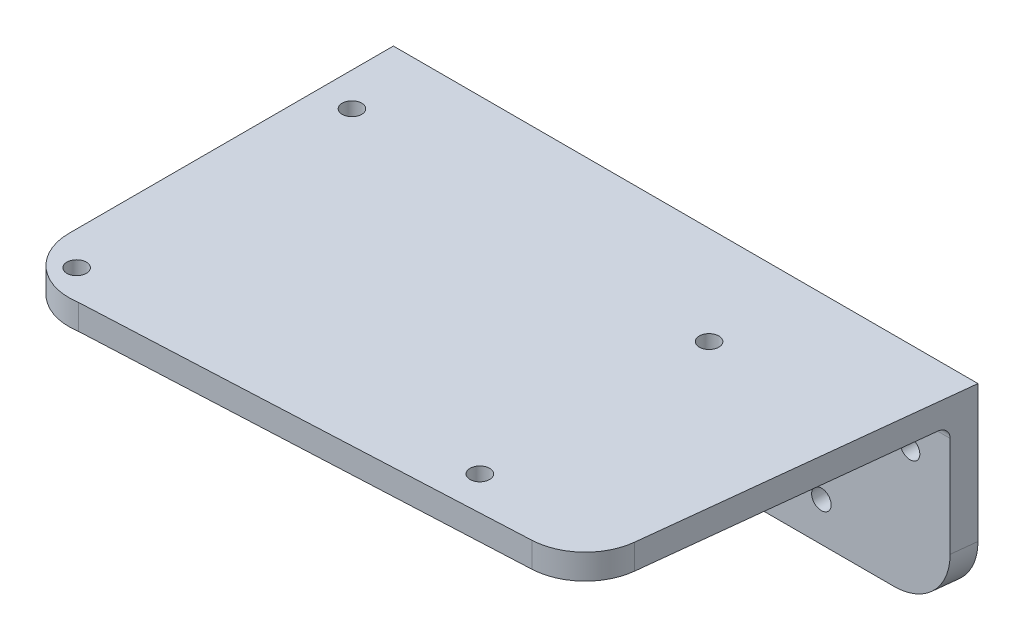
ISO-10303-21;
HEADER;
FILE_DESCRIPTION(('STEP AP214'),'2;1');
FILE_NAME('part.step','',(''),(''),'','','');
FILE_SCHEMA(('AUTOMOTIVE_DESIGN { 1 0 10303 214 1 1 1 1 }'));
ENDSEC;
DATA;
#1=APPLICATION_CONTEXT('core data for automotive mechanical design processes');
#2=APPLICATION_PROTOCOL_DEFINITION('international standard','automotive_design',2000,#1);
#3=PRODUCT_CONTEXT('',#1,'mechanical');
#4=PRODUCT('Part','Part','',(#3));
#5=PRODUCT_RELATED_PRODUCT_CATEGORY('part','',(#4));
#6=PRODUCT_DEFINITION_FORMATION('','',#4);
#7=PRODUCT_DEFINITION_CONTEXT('part definition',#1,'design');
#8=PRODUCT_DEFINITION('design','',#6,#7);
#9=PRODUCT_DEFINITION_SHAPE('','',#8);
#10=(LENGTH_UNIT() NAMED_UNIT(*) SI_UNIT(.MILLI.,.METRE.));
#11=(NAMED_UNIT(*) PLANE_ANGLE_UNIT() SI_UNIT($,.RADIAN.));
#12=(NAMED_UNIT(*) SI_UNIT($,.STERADIAN.) SOLID_ANGLE_UNIT());
#13=UNCERTAINTY_MEASURE_WITH_UNIT(LENGTH_MEASURE(1.E-05),#10,'distance_accuracy_value','');
#14=(GEOMETRIC_REPRESENTATION_CONTEXT(3) GLOBAL_UNCERTAINTY_ASSIGNED_CONTEXT((#13)) GLOBAL_UNIT_ASSIGNED_CONTEXT((#10,
#11,#12)) REPRESENTATION_CONTEXT('',''));
#15=CARTESIAN_POINT('',(0.,0.,0.));
#16=DIRECTION('',(0.,0.,1.));
#17=DIRECTION('',(1.,0.,0.));
#18=AXIS2_PLACEMENT_3D('',#15,#16,#17);
#19=CARTESIAN_POINT('',(0.,0.,0.));
#20=DIRECTION('',(0.,1.,0.));
#21=DIRECTION('',(0.,0.,1.));
#22=AXIS2_PLACEMENT_3D('',#19,#20,#21);
#23=PLANE('',#22);
#24=CARTESIAN_POINT('',(-43.7355525514214,0.,-28.3752913949086));
#25=DIRECTION('',(0.,1.,0.));
#26=DIRECTION('',(0.,0.,1.));
#27=AXIS2_PLACEMENT_3D('',#24,#25,#26);
#28=CIRCLE('',#27,1.75);
#29=CARTESIAN_POINT('',(-43.7355525514214,0.,-26.6252913949086));
#30=VERTEX_POINT('',#29);
#31=EDGE_CURVE('E391',#30,#30,#28,.F.);
#32=ORIENTED_EDGE('',*,*,#31,.F.);
#33=EDGE_LOOP('',(#32));
#34=FACE_BOUND('',#33,.T.);
#35=CARTESIAN_POINT('',(-43.7355525514214,0.,20.9485580018877));
#36=DIRECTION('',(0.,1.,0.));
#37=DIRECTION('',(0.,0.,1.));
#38=AXIS2_PLACEMENT_3D('',#35,#36,#37);
#39=CIRCLE('',#38,1.75);
#40=CARTESIAN_POINT('',(-43.7355525514214,0.,22.6985580018877));
#41=VERTEX_POINT('',#40);
#42=EDGE_CURVE('E392',#41,#41,#39,.F.);
#43=ORIENTED_EDGE('',*,*,#42,.F.);
#44=EDGE_LOOP('',(#43));
#45=FACE_BOUND('',#44,.T.);
#46=CARTESIAN_POINT('',(24.3726184912332,0.,16.8165832662366));
#47=DIRECTION('',(0.,1.,0.));
#48=DIRECTION('',(0.,0.,1.));
#49=AXIS2_PLACEMENT_3D('',#46,#47,#48);
#50=CIRCLE('',#49,1.75);
#51=CARTESIAN_POINT('',(24.3726184912332,0.,18.5665832662366));
#52=VERTEX_POINT('',#51);
#53=EDGE_CURVE('E401',#52,#52,#50,.F.);
#54=ORIENTED_EDGE('',*,*,#53,.F.);
#55=EDGE_LOOP('',(#54));
#56=FACE_BOUND('',#55,.T.);
#57=CARTESIAN_POINT('',(24.3726184912332,0.,-24.2433166592575));
#58=DIRECTION('',(0.,1.,0.));
#59=DIRECTION('',(0.,0.,1.));
#60=AXIS2_PLACEMENT_3D('',#57,#58,#59);
#61=CIRCLE('',#60,1.75);
#62=CARTESIAN_POINT('',(24.3726184912332,0.,-22.4933166592575));
#63=VERTEX_POINT('',#62);
#64=EDGE_CURVE('E409',#63,#63,#61,.F.);
#65=ORIENTED_EDGE('',*,*,#64,.F.);
#66=EDGE_LOOP('',(#65));
#67=FACE_BOUND('',#66,.T.);
#68=DIRECTION('',(0.,0.,-1.));
#69=VECTOR('',#68,1.);
#70=CARTESIAN_POINT('',(-8.13875231369826,0.,0.));
#71=LINE('',#70,#69);
#72=CARTESIAN_POINT('',(-8.13875231369825,0.,14.3090968347566));
#73=VERTEX_POINT('',#72);
#74=CARTESIAN_POINT('',(-8.13875231369825,0.,-35.320488279099));
#75=VERTEX_POINT('',#74);
#76=EDGE_CURVE('E288',#73,#75,#71,.T.);
#77=ORIENTED_EDGE('',*,*,#76,.T.);
#78=DIRECTION('',(-1.,0.,0.));
#79=VECTOR('',#78,1.);
#80=CARTESIAN_POINT('',(12.8612587318722,0.,-35.320488279099));
#81=LINE('',#80,#79);
#82=CARTESIAN_POINT('',(12.8612587318722,0.,-35.320488279099));
#83=VERTEX_POINT('',#82);
#84=EDGE_CURVE('E55',#75,#83,#81,.F.);
#85=ORIENTED_EDGE('',*,*,#84,.T.);
#86=DIRECTION('',(0.,0.,-1.));
#87=VECTOR('',#86,1.);
#88=CARTESIAN_POINT('',(12.8612587318722,0.,0.));
#89=LINE('',#88,#87);
#90=CARTESIAN_POINT('',(12.8612587318722,0.,14.3163231512288));
#91=VERTEX_POINT('',#90);
#92=EDGE_CURVE('E511',#91,#83,#89,.T.);
#93=ORIENTED_EDGE('',*,*,#92,.F.);
#94=DIRECTION('',(-0.999999940794115,0.,-0.000344110106829178));
#95=VECTOR('',#94,1.);
#96=CARTESIAN_POINT('',(-0.00492486827294444,0.,14.3118957671535));
#97=LINE('',#96,#95);
#98=CARTESIAN_POINT('',(17.86126136177,0.,14.3180437027698));
#99=VERTEX_POINT('',#98);
#100=EDGE_CURVE('E505',#91,#99,#97,.F.);
#101=ORIENTED_EDGE('',*,*,#100,.T.);
#102=DIRECTION('',(0.,0.,-1.));
#103=VECTOR('',#102,1.);
#104=CARTESIAN_POINT('',(17.86126136177,0.,0.));
#105=LINE('',#104,#103);
#106=CARTESIAN_POINT('',(17.86126136177,0.,-35.320488279099));
#107=VERTEX_POINT('',#106);
#108=EDGE_CURVE('E205',#99,#107,#105,.T.);
#109=ORIENTED_EDGE('',*,*,#108,.T.);
#110=DIRECTION('',(-1.,0.,0.));
#111=VECTOR('',#110,1.);
#112=CARTESIAN_POINT('',(54.4781860689173,0.,-35.320488279099));
#113=LINE('',#112,#111);
#114=CARTESIAN_POINT('',(54.2559638468458,0.,-35.320488279099));
#115=VERTEX_POINT('',#114);
#116=EDGE_CURVE('E476',#107,#115,#113,.F.);
#117=ORIENTED_EDGE('',*,*,#116,.T.);
#118=DIRECTION('',(-0.110431526000871,0.,0.993883734681838));
#119=VECTOR('',#118,1.);
#120=CARTESIAN_POINT('',(47.8824170916456,0.,22.0414325566029));
#121=LINE('',#120,#119);
#122=CARTESIAN_POINT('',(48.824230953217,0.,13.5651077967123));
#123=VERTEX_POINT('',#122);
#124=EDGE_CURVE('E341',#115,#123,#121,.T.);
#125=ORIENTED_EDGE('',*,*,#124,.T.);
#126=CARTESIAN_POINT('',(38.8853936063986,0.,12.4607925367035));
#127=DIRECTION('',(0.,1.,0.));
#128=DIRECTION('',(0.,0.,1.));
#129=AXIS2_PLACEMENT_3D('',#126,#127,#128);
#130=CIRCLE('',#129,10.);
#131=CARTESIAN_POINT('',(39.3636906542397,0.,22.4493475840578));
#132=VERTEX_POINT('',#131);
#133=EDGE_CURVE('E429',#123,#132,#130,.F.);
#134=ORIENTED_EDGE('',*,*,#133,.T.);
#135=DIRECTION('',(-0.998855504735428,0.,0.0478297047841053));
#136=VECTOR('',#135,1.);
#137=CARTESIAN_POINT('',(-38.1869562222665,0.,26.1628221840723));
#138=LINE('',#137,#136);
#139=CARTESIAN_POINT('',(-38.1869562222665,0.,26.1628221840723));
#140=VERTEX_POINT('',#139);
#141=EDGE_CURVE('E374',#132,#140,#138,.T.);
#142=ORIENTED_EDGE('',*,*,#141,.T.);
#143=CARTESIAN_POINT('',(-39.7556796507434,0.,16.2866333034895));
#144=DIRECTION('',(0.,1.,0.));
#145=DIRECTION('',(0.,0.,1.));
#146=AXIS2_PLACEMENT_3D('',#143,#144,#145);
#147=CIRCLE('',#146,9.99999999999999);
#148=CARTESIAN_POINT('',(-49.7556796507434,0.,16.2866333034895));
#149=VERTEX_POINT('',#148);
#150=EDGE_CURVE('E347',#140,#149,#147,.F.);
#151=ORIENTED_EDGE('',*,*,#150,.T.);
#152=DIRECTION('',(0.,0.,-1.));
#153=VECTOR('',#152,1.);
#154=CARTESIAN_POINT('',(-49.7556796507434,0.,16.2866333034895));
#155=LINE('',#154,#153);
#156=CARTESIAN_POINT('',(-49.7556796507434,0.,-35.320488279099));
#157=VERTEX_POINT('',#156);
#158=EDGE_CURVE('E344',#149,#157,#155,.T.);
#159=ORIENTED_EDGE('',*,*,#158,.T.);
#160=DIRECTION('',(-1.,0.,0.));
#161=VECTOR('',#160,1.);
#162=CARTESIAN_POINT('',(-13.138754943596,0.,-35.320488279099));
#163=LINE('',#162,#161);
#164=CARTESIAN_POINT('',(-13.138754943596,0.,-35.320488279099));
#165=VERTEX_POINT('',#164);
#166=EDGE_CURVE('E62',#157,#165,#163,.F.);
#167=ORIENTED_EDGE('',*,*,#166,.T.);
#168=DIRECTION('',(0.,0.,-1.));
#169=VECTOR('',#168,1.);
#170=CARTESIAN_POINT('',(-13.138754943596,0.,0.));
#171=LINE('',#170,#169);
#172=CARTESIAN_POINT('',(-13.138754943596,0.,14.3073762832156));
#173=VERTEX_POINT('',#172);
#174=EDGE_CURVE('E282',#173,#165,#171,.T.);
#175=ORIENTED_EDGE('',*,*,#174,.F.);
#176=DIRECTION('',(-0.999999940794115,0.,-0.000344110106829178));
#177=VECTOR('',#176,1.);
#178=CARTESIAN_POINT('',(-0.00492486827294444,0.,14.3118957671535));
#179=LINE('',#178,#177);
#180=EDGE_CURVE('E291',#173,#73,#179,.F.);
#181=ORIENTED_EDGE('',*,*,#180,.T.);
#182=EDGE_LOOP('',(#77,#85,#93,#101,#109,#117,#125,#134,#142,#151,#159,#167,#175,#181));
#183=FACE_BOUND('',#182,.T.);
#184=ADVANCED_FACE('F39',(#34,#45,#56,#67,#183),#23,.F.);
#185=CARTESIAN_POINT('',(0.,4.5,0.));
#186=DIRECTION('',(0.,1.,0.));
#187=DIRECTION('',(0.,0.,1.));
#188=AXIS2_PLACEMENT_3D('',#185,#186,#187);
#189=PLANE('',#188);
#190=DIRECTION('',(-1.,0.,0.));
#191=VECTOR('',#190,1.);
#192=CARTESIAN_POINT('',(-49.7556796507434,4.5,-41.820488279099));
#193=LINE('',#192,#191);
#194=CARTESIAN_POINT('',(54.9781860685783,4.5,-41.820488279099));
#195=VERTEX_POINT('',#194);
#196=CARTESIAN_POINT('',(-49.7556796507434,4.5,-41.820488279099));
#197=VERTEX_POINT('',#196);
#198=EDGE_CURVE('E363',#195,#197,#193,.T.);
#199=ORIENTED_EDGE('',*,*,#198,.T.);
#200=DIRECTION('',(0.,0.,1.));
#201=VECTOR('',#200,1.);
#202=CARTESIAN_POINT('',(-49.7556796507434,4.5,16.2866333034895));
#203=LINE('',#202,#201);
#204=CARTESIAN_POINT('',(-49.7556796507434,4.5,16.2866333034895));
#205=VERTEX_POINT('',#204);
#206=EDGE_CURVE('E366',#197,#205,#203,.T.);
#207=ORIENTED_EDGE('',*,*,#206,.T.);
#208=CARTESIAN_POINT('',(-39.7556796507434,4.5,16.2866333034895));
#209=DIRECTION('',(0.,1.,0.));
#210=DIRECTION('',(0.,0.,1.));
#211=AXIS2_PLACEMENT_3D('',#208,#209,#210);
#212=CIRCLE('',#211,9.99999999999999);
#213=CARTESIAN_POINT('',(-38.1869562222665,4.5,26.1628221840723));
#214=VERTEX_POINT('',#213);
#215=EDGE_CURVE('E351',#205,#214,#212,.T.);
#216=ORIENTED_EDGE('',*,*,#215,.T.);
#217=DIRECTION('',(0.998855504735427,0.,-0.0478297047841053));
#218=VECTOR('',#217,1.);
#219=CARTESIAN_POINT('',(-38.1869562222665,4.5,26.1628221840723));
#220=LINE('',#219,#218);
#221=CARTESIAN_POINT('',(39.3636906542397,4.5,22.4493475840578));
#222=VERTEX_POINT('',#221);
#223=EDGE_CURVE('E355',#214,#222,#220,.T.);
#224=ORIENTED_EDGE('',*,*,#223,.T.);
#225=CARTESIAN_POINT('',(38.8853936063986,4.5,12.4607925367035));
#226=DIRECTION('',(0.,1.,0.));
#227=DIRECTION('',(0.,0.,1.));
#228=AXIS2_PLACEMENT_3D('',#225,#226,#227);
#229=CIRCLE('',#228,10.);
#230=CARTESIAN_POINT('',(48.824230953217,4.5,13.5651077967123));
#231=VERTEX_POINT('',#230);
#232=EDGE_CURVE('E422',#222,#231,#229,.T.);
#233=ORIENTED_EDGE('',*,*,#232,.T.);
#234=DIRECTION('',(0.110431526000871,0.,-0.993883734681839));
#235=VECTOR('',#234,1.);
#236=CARTESIAN_POINT('',(47.8824170916456,4.5,22.0414325566029));
#237=LINE('',#236,#235);
#238=EDGE_CURVE('E359',#231,#195,#237,.T.);
#239=ORIENTED_EDGE('',*,*,#238,.T.);
#240=EDGE_LOOP('',(#199,#207,#216,#224,#233,#239));
#241=FACE_BOUND('',#240,.T.);
#242=CARTESIAN_POINT('',(24.3726184912332,4.5,-24.2433166592575));
#243=DIRECTION('',(0.,1.,0.));
#244=DIRECTION('',(0.,0.,1.));
#245=AXIS2_PLACEMENT_3D('',#242,#243,#244);
#246=CIRCLE('',#245,1.75);
#247=CARTESIAN_POINT('',(24.3726184912332,4.5,-22.4933166592575));
#248=VERTEX_POINT('',#247);
#249=EDGE_CURVE('E386',#248,#248,#246,.T.);
#250=ORIENTED_EDGE('',*,*,#249,.F.);
#251=EDGE_LOOP('',(#250));
#252=FACE_BOUND('',#251,.T.);
#253=CARTESIAN_POINT('',(24.3726184912332,4.5,16.8165832662366));
#254=DIRECTION('',(0.,1.,0.));
#255=DIRECTION('',(0.,0.,1.));
#256=AXIS2_PLACEMENT_3D('',#253,#254,#255);
#257=CIRCLE('',#256,1.75);
#258=CARTESIAN_POINT('',(24.3726184912332,4.5,18.5665832662366));
#259=VERTEX_POINT('',#258);
#260=EDGE_CURVE('E405',#259,#259,#257,.T.);
#261=ORIENTED_EDGE('',*,*,#260,.F.);
#262=EDGE_LOOP('',(#261));
#263=FACE_BOUND('',#262,.T.);
#264=CARTESIAN_POINT('',(-43.7355525514214,4.5,20.9485580018877));
#265=DIRECTION('',(0.,1.,0.));
#266=DIRECTION('',(0.,0.,1.));
#267=AXIS2_PLACEMENT_3D('',#264,#265,#266);
#268=CIRCLE('',#267,1.75);
#269=CARTESIAN_POINT('',(-43.7355525514214,4.5,22.6985580018877));
#270=VERTEX_POINT('',#269);
#271=EDGE_CURVE('E397',#270,#270,#268,.T.);
#272=ORIENTED_EDGE('',*,*,#271,.F.);
#273=EDGE_LOOP('',(#272));
#274=FACE_BOUND('',#273,.T.);
#275=CARTESIAN_POINT('',(-43.7355525514214,4.5,-28.3752913949086));
#276=DIRECTION('',(0.,1.,0.));
#277=DIRECTION('',(0.,0.,1.));
#278=AXIS2_PLACEMENT_3D('',#275,#276,#277);
#279=CIRCLE('',#278,1.75);
#280=CARTESIAN_POINT('',(-43.7355525514214,4.5,-26.6252913949086));
#281=VERTEX_POINT('',#280);
#282=EDGE_CURVE('E387',#281,#281,#279,.T.);
#283=ORIENTED_EDGE('',*,*,#282,.F.);
#284=EDGE_LOOP('',(#283));
#285=FACE_BOUND('',#284,.T.);
#286=ADVANCED_FACE('F558',(#241,#252,#263,#274,#285),#189,.T.);
#287=CARTESIAN_POINT('',(24.3726184912332,-0.00100000000000013,-24.2433166592575));
#288=DIRECTION('',(0.,1.,0.));
#289=DIRECTION('',(0.,0.,1.));
#290=AXIS2_PLACEMENT_3D('',#287,#288,#289);
#291=CYLINDRICAL_SURFACE('',#290,1.75);
#292=ORIENTED_EDGE('',*,*,#249,.T.);
#293=EDGE_LOOP('',(#292));
#294=FACE_BOUND('',#293,.T.);
#295=ORIENTED_EDGE('',*,*,#64,.T.);
#296=EDGE_LOOP('',(#295));
#297=FACE_BOUND('',#296,.T.);
#298=ADVANCED_FACE('F566',(#294,#297),#291,.F.);
#299=CARTESIAN_POINT('',(24.3726184912332,-0.00100000000000013,16.8165832662366));
#300=DIRECTION('',(0.,1.,0.));
#301=DIRECTION('',(0.,0.,1.));
#302=AXIS2_PLACEMENT_3D('',#299,#300,#301);
#303=CYLINDRICAL_SURFACE('',#302,1.75);
#304=ORIENTED_EDGE('',*,*,#260,.T.);
#305=EDGE_LOOP('',(#304));
#306=FACE_BOUND('',#305,.T.);
#307=ORIENTED_EDGE('',*,*,#53,.T.);
#308=EDGE_LOOP('',(#307));
#309=FACE_BOUND('',#308,.T.);
#310=ADVANCED_FACE('F645',(#306,#309),#303,.F.);
#311=CARTESIAN_POINT('',(-43.7355525514214,-0.00100000000000013,20.9485580018877));
#312=DIRECTION('',(0.,1.,0.));
#313=DIRECTION('',(0.,0.,1.));
#314=AXIS2_PLACEMENT_3D('',#311,#312,#313);
#315=CYLINDRICAL_SURFACE('',#314,1.75);
#316=ORIENTED_EDGE('',*,*,#271,.T.);
#317=EDGE_LOOP('',(#316));
#318=FACE_BOUND('',#317,.T.);
#319=ORIENTED_EDGE('',*,*,#42,.T.);
#320=EDGE_LOOP('',(#319));
#321=FACE_BOUND('',#320,.T.);
#322=ADVANCED_FACE('F637',(#318,#321),#315,.F.);
#323=CARTESIAN_POINT('',(-43.7355525514214,-0.00100000000000013,-28.3752913949086));
#324=DIRECTION('',(0.,1.,0.));
#325=DIRECTION('',(0.,0.,1.));
#326=AXIS2_PLACEMENT_3D('',#323,#324,#325);
#327=CYLINDRICAL_SURFACE('',#326,1.75);
#328=ORIENTED_EDGE('',*,*,#282,.T.);
#329=EDGE_LOOP('',(#328));
#330=FACE_BOUND('',#329,.T.);
#331=ORIENTED_EDGE('',*,*,#31,.T.);
#332=EDGE_LOOP('',(#331));
#333=FACE_BOUND('',#332,.T.);
#334=ADVANCED_FACE('F630',(#330,#333),#327,.F.);
#335=CARTESIAN_POINT('',(-39.7556796507434,-0.00100000000000013,16.2866333034895));
#336=DIRECTION('',(0.,1.,0.));
#337=DIRECTION('',(0.,0.,1.));
#338=AXIS2_PLACEMENT_3D('',#335,#336,#337);
#339=CYLINDRICAL_SURFACE('',#338,9.99999999999999);
#340=DIRECTION('',(0.,1.,0.));
#341=VECTOR('',#340,1.);
#342=CARTESIAN_POINT('',(-38.1869562222665,-0.00100000000000013,26.1628221840723));
#343=LINE('',#342,#341);
#344=EDGE_CURVE('E370',#140,#214,#343,.T.);
#345=ORIENTED_EDGE('',*,*,#344,.T.);
#346=ORIENTED_EDGE('',*,*,#215,.F.);
#347=DIRECTION('',(0.,1.,0.));
#348=VECTOR('',#347,1.);
#349=CARTESIAN_POINT('',(-49.7556796507434,-0.00100000000000013,16.2866333034895));
#350=LINE('',#349,#348);
#351=EDGE_CURVE('E371',#149,#205,#350,.T.);
#352=ORIENTED_EDGE('',*,*,#351,.F.);
#353=ORIENTED_EDGE('',*,*,#150,.F.);
#354=EDGE_LOOP('',(#345,#346,#352,#353));
#355=FACE_BOUND('',#354,.T.);
#356=ADVANCED_FACE('F628',(#355),#339,.T.);
#357=CARTESIAN_POINT('',(-49.7556796507434,-0.00100000000000013,16.2866333034895));
#358=DIRECTION('',(-1.,0.,0.));
#359=DIRECTION('',(0.,0.,1.));
#360=AXIS2_PLACEMENT_3D('',#357,#358,#359);
#361=PLANE('',#360);
#362=DIRECTION('',(0.,1.,0.));
#363=VECTOR('',#362,1.);
#364=CARTESIAN_POINT('',(-49.7556796507434,-0.00100000000000013,-41.820488279099));
#365=LINE('',#364,#363);
#366=CARTESIAN_POINT('',(-49.7556796507434,-20.,-41.820488279099));
#367=VERTEX_POINT('',#366);
#368=EDGE_CURVE('E375',#367,#197,#365,.T.);
#369=ORIENTED_EDGE('',*,*,#368,.F.);
#370=DIRECTION('',(0.,0.,-1.));
#371=VECTOR('',#370,1.);
#372=CARTESIAN_POINT('',(-49.7556796507434,-20.,16.2866333034895));
#373=LINE('',#372,#371);
#374=CARTESIAN_POINT('',(-49.7556796507434,-20.,-37.320488279099));
#375=VERTEX_POINT('',#374);
#376=EDGE_CURVE('E456',#367,#375,#373,.F.);
#377=ORIENTED_EDGE('',*,*,#376,.T.);
#378=DIRECTION('',(0.,1.,0.));
#379=VECTOR('',#378,1.);
#380=CARTESIAN_POINT('',(-49.7556796507434,-30.,-37.320488279099));
#381=LINE('',#380,#379);
#382=CARTESIAN_POINT('',(-49.7556796507434,-2.,-37.320488279099));
#383=VERTEX_POINT('',#382);
#384=EDGE_CURVE('E337',#375,#383,#381,.T.);
#385=ORIENTED_EDGE('',*,*,#384,.T.);
#386=CARTESIAN_POINT('',(-49.7556796507434,-2.,-35.320488279099));
#387=DIRECTION('',(-1.,0.,0.));
#388=DIRECTION('',(0.,0.,1.));
#389=AXIS2_PLACEMENT_3D('',#386,#387,#388);
#390=CIRCLE('',#389,2.);
#391=EDGE_CURVE('E11',#383,#157,#390,.F.);
#392=ORIENTED_EDGE('',*,*,#391,.T.);
#393=ORIENTED_EDGE('',*,*,#158,.F.);
#394=ORIENTED_EDGE('',*,*,#351,.T.);
#395=ORIENTED_EDGE('',*,*,#206,.F.);
#396=EDGE_LOOP('',(#369,#377,#385,#392,#393,#394,#395));
#397=FACE_BOUND('',#396,.T.);
#398=ADVANCED_FACE('F602',(#397),#361,.T.);
#399=CARTESIAN_POINT('',(-49.7556796507434,-0.00100000000000013,-41.820488279099));
#400=DIRECTION('',(0.,0.,-1.));
#401=DIRECTION('',(-1.,0.,0.));
#402=AXIS2_PLACEMENT_3D('',#399,#400,#401);
#403=PLANE('',#402);
#404=CARTESIAN_POINT('',(44.9166470262866,-20.,-41.820488279099));
#405=DIRECTION('',(0.,0.,-1.));
#406=DIRECTION('',(-1.,0.,0.));
#407=AXIS2_PLACEMENT_3D('',#404,#405,#406);
#408=ELLIPSE('',#407,10.0615390422917,10.);
#409=CARTESIAN_POINT('',(54.9781860685783,-20.,-41.820488279099));
#410=VERTEX_POINT('',#409);
#411=CARTESIAN_POINT('',(44.9166470262866,-30.,-41.820488279099));
#412=VERTEX_POINT('',#411);
#413=EDGE_CURVE('E452',#410,#412,#408,.T.);
#414=ORIENTED_EDGE('',*,*,#413,.T.);
#415=DIRECTION('',(1.,0.,0.));
#416=VECTOR('',#415,1.);
#417=CARTESIAN_POINT('',(-49.7556796507434,-30.,-41.820488279099));
#418=LINE('',#417,#416);
#419=CARTESIAN_POINT('',(-39.7556796507434,-30.,-41.820488279099));
#420=VERTEX_POINT('',#419);
#421=EDGE_CURVE('E330',#420,#412,#418,.T.);
#422=ORIENTED_EDGE('',*,*,#421,.F.);
#423=CARTESIAN_POINT('',(-39.7556796507434,-20.,-41.820488279099));
#424=DIRECTION('',(0.,0.,-1.));
#425=DIRECTION('',(-1.,0.,0.));
#426=AXIS2_PLACEMENT_3D('',#423,#424,#425);
#427=CIRCLE('',#426,10.);
#428=EDGE_CURVE('E449',#420,#367,#427,.T.);
#429=ORIENTED_EDGE('',*,*,#428,.T.);
#430=ORIENTED_EDGE('',*,*,#368,.T.);
#431=ORIENTED_EDGE('',*,*,#198,.F.);
#432=DIRECTION('',(0.,1.,0.));
#433=VECTOR('',#432,1.);
#434=CARTESIAN_POINT('',(54.9781860685783,-0.00100000000000013,-41.820488279099));
#435=LINE('',#434,#433);
#436=EDGE_CURVE('E379',#410,#195,#435,.T.);
#437=ORIENTED_EDGE('',*,*,#436,.F.);
#438=EDGE_LOOP('',(#414,#422,#429,#430,#431,#437));
#439=FACE_BOUND('',#438,.T.);
#440=CARTESIAN_POINT('',(31.4159952128189,-22.9885805247236,-41.820488279099));
#441=DIRECTION('',(0.,0.,-1.));
#442=DIRECTION('',(-1.,0.,0.));
#443=AXIS2_PLACEMENT_3D('',#440,#441,#442);
#444=CIRCLE('',#443,1.75000000000004);
#445=CARTESIAN_POINT('',(29.6659952128189,-22.9885805247236,-41.820488279099));
#446=VERTEX_POINT('',#445);
#447=EDGE_CURVE('E316',#446,#446,#444,.F.);
#448=ORIENTED_EDGE('',*,*,#447,.T.);
#449=EDGE_LOOP('',(#448));
#450=FACE_BOUND('',#449,.T.);
#451=CARTESIAN_POINT('',(47.3063554507961,-7.16327873740824,-41.820488279099));
#452=DIRECTION('',(0.,0.,-1.));
#453=DIRECTION('',(-1.,0.,0.));
#454=AXIS2_PLACEMENT_3D('',#451,#452,#453);
#455=CIRCLE('',#454,1.75000000000004);
#456=CARTESIAN_POINT('',(45.5563554507961,-7.16327873740824,-41.820488279099));
#457=VERTEX_POINT('',#456);
#458=EDGE_CURVE('E294',#457,#457,#455,.F.);
#459=ORIENTED_EDGE('',*,*,#458,.T.);
#460=EDGE_LOOP('',(#459));
#461=FACE_BOUND('',#460,.T.);
#462=CARTESIAN_POINT('',(-42.5984485001936,-7.07106781186546,-41.820488279099));
#463=DIRECTION('',(0.,0.,-1.));
#464=DIRECTION('',(-1.,0.,0.));
#465=AXIS2_PLACEMENT_3D('',#462,#463,#464);
#466=CIRCLE('',#465,1.75000000000004);
#467=CARTESIAN_POINT('',(-44.3484485001937,-7.07106781186546,-41.820488279099));
#468=VERTEX_POINT('',#467);
#469=EDGE_CURVE('E300',#468,#468,#466,.F.);
#470=ORIENTED_EDGE('',*,*,#469,.T.);
#471=EDGE_LOOP('',(#470));
#472=FACE_BOUND('',#471,.T.);
#473=CARTESIAN_POINT('',(-26.7405841239244,-22.9289321881346,-41.820488279099));
#474=DIRECTION('',(0.,0.,-1.));
#475=DIRECTION('',(-1.,0.,0.));
#476=AXIS2_PLACEMENT_3D('',#473,#474,#475);
#477=CIRCLE('',#476,1.75000000000004);
#478=CARTESIAN_POINT('',(-28.4905841239244,-22.9289321881346,-41.820488279099));
#479=VERTEX_POINT('',#478);
#480=EDGE_CURVE('E308',#479,#479,#477,.F.);
#481=ORIENTED_EDGE('',*,*,#480,.T.);
#482=EDGE_LOOP('',(#481));
#483=FACE_BOUND('',#482,.T.);
#484=ADVANCED_FACE('F614',(#439,#450,#461,#472,#483),#403,.T.);
#485=CARTESIAN_POINT('',(47.8824170916456,-0.00100000000000013,22.0414325566029));
#486=DIRECTION('',(0.993883734681838,0.,0.110431526000871));
#487=DIRECTION('',(0.110431526000871,0.,-0.993883734681838));
#488=AXIS2_PLACEMENT_3D('',#485,#486,#487);
#489=PLANE('',#488);
#490=DIRECTION('',(0.,1.,0.));
#491=VECTOR('',#490,1.);
#492=CARTESIAN_POINT('',(54.4781860689173,-30.,-37.320488279099));
#493=LINE('',#492,#491);
#494=CARTESIAN_POINT('',(54.4781860689173,-20.,-37.320488279099));
#495=VERTEX_POINT('',#494);
#496=CARTESIAN_POINT('',(54.4781860689173,-2.,-37.320488279099));
#497=VERTEX_POINT('',#496);
#498=EDGE_CURVE('E333',#495,#497,#493,.T.);
#499=ORIENTED_EDGE('',*,*,#498,.F.);
#500=DIRECTION('',(-0.110431526000871,0.,0.993883734681838));
#501=VECTOR('',#500,1.);
#502=CARTESIAN_POINT('',(47.8824170916456,-20.,22.0414325566029));
#503=LINE('',#502,#501);
#504=EDGE_CURVE('E446',#495,#410,#503,.F.);
#505=ORIENTED_EDGE('',*,*,#504,.T.);
#506=ORIENTED_EDGE('',*,*,#436,.T.);
#507=ORIENTED_EDGE('',*,*,#238,.F.);
#508=DIRECTION('',(0.,1.,0.));
#509=VECTOR('',#508,1.);
#510=CARTESIAN_POINT('',(48.824230953217,-0.00100000000000013,13.5651077967123));
#511=LINE('',#510,#509);
#512=EDGE_CURVE('E425',#231,#123,#511,.F.);
#513=ORIENTED_EDGE('',*,*,#512,.T.);
#514=ORIENTED_EDGE('',*,*,#124,.F.);
#515=CARTESIAN_POINT('',(54.2559638468458,-2.,-35.320488279099));
#516=DIRECTION('',(0.993883734681838,0.,0.110431526000871));
#517=DIRECTION('',(0.110431526000871,0.,-0.993883734681838));
#518=AXIS2_PLACEMENT_3D('',#515,#516,#517);
#519=ELLIPSE('',#518,2.01230780845834,2.);
#520=EDGE_CURVE('E48',#115,#497,#519,.F.);
#521=ORIENTED_EDGE('',*,*,#520,.T.);
#522=EDGE_LOOP('',(#499,#505,#506,#507,#513,#514,#521));
#523=FACE_BOUND('',#522,.T.);
#524=ADVANCED_FACE('F494',(#523),#489,.T.);
#525=CARTESIAN_POINT('',(-38.1869562222665,-0.00100000000000013,26.1628221840723));
#526=DIRECTION('',(0.0478297047841053,0.,0.998855504735427));
#527=DIRECTION('',(0.998855504735428,0.,-0.0478297047841053));
#528=AXIS2_PLACEMENT_3D('',#525,#526,#527);
#529=PLANE('',#528);
#530=ORIENTED_EDGE('',*,*,#141,.F.);
#531=DIRECTION('',(0.,1.,0.));
#532=VECTOR('',#531,1.);
#533=CARTESIAN_POINT('',(39.3636906542397,-0.00100000000000013,22.4493475840578));
#534=LINE('',#533,#532);
#535=EDGE_CURVE('E396',#132,#222,#534,.T.);
#536=ORIENTED_EDGE('',*,*,#535,.T.);
#537=ORIENTED_EDGE('',*,*,#223,.F.);
#538=ORIENTED_EDGE('',*,*,#344,.F.);
#539=EDGE_LOOP('',(#530,#536,#537,#538));
#540=FACE_BOUND('',#539,.T.);
#541=ADVANCED_FACE('F576',(#540),#529,.T.);
#542=CARTESIAN_POINT('',(38.8853936063986,-0.00100000000000013,12.4607925367035));
#543=DIRECTION('',(0.,1.,0.));
#544=DIRECTION('',(0.,0.,1.));
#545=AXIS2_PLACEMENT_3D('',#542,#543,#544);
#546=CYLINDRICAL_SURFACE('',#545,10.);
#547=ORIENTED_EDGE('',*,*,#133,.F.);
#548=ORIENTED_EDGE('',*,*,#512,.F.);
#549=ORIENTED_EDGE('',*,*,#232,.F.);
#550=ORIENTED_EDGE('',*,*,#535,.F.);
#551=EDGE_LOOP('',(#547,#548,#549,#550));
#552=FACE_BOUND('',#551,.T.);
#553=ADVANCED_FACE('F573',(#552),#546,.T.);
#554=CARTESIAN_POINT('',(54.4781860689173,-30.,-37.320488279099));
#555=DIRECTION('',(0.,0.,-1.));
#556=DIRECTION('',(-1.,0.,0.));
#557=AXIS2_PLACEMENT_3D('',#554,#555,#556);
#558=PLANE('',#557);
#559=CARTESIAN_POINT('',(-42.5984485001936,-7.07106781186546,-37.320488279099));
#560=DIRECTION('',(0.,0.,1.));
#561=DIRECTION('',(1.,0.,0.));
#562=AXIS2_PLACEMENT_3D('',#559,#560,#561);
#563=CIRCLE('',#562,1.75000000000004);
#564=CARTESIAN_POINT('',(-40.8484485001936,-7.07106781186546,-37.320488279099));
#565=VERTEX_POINT('',#564);
#566=EDGE_CURVE('E295',#565,#565,#563,.T.);
#567=ORIENTED_EDGE('',*,*,#566,.F.);
#568=EDGE_LOOP('',(#567));
#569=FACE_BOUND('',#568,.T.);
#570=CARTESIAN_POINT('',(-26.7405841239244,-22.9289321881346,-37.320488279099));
#571=DIRECTION('',(0.,0.,1.));
#572=DIRECTION('',(1.,0.,0.));
#573=AXIS2_PLACEMENT_3D('',#570,#571,#572);
#574=CIRCLE('',#573,1.75000000000004);
#575=CARTESIAN_POINT('',(-24.9905841239243,-22.9289321881346,-37.320488279099));
#576=VERTEX_POINT('',#575);
#577=EDGE_CURVE('E304',#576,#576,#574,.T.);
#578=ORIENTED_EDGE('',*,*,#577,.F.);
#579=EDGE_LOOP('',(#578));
#580=FACE_BOUND('',#579,.T.);
#581=CARTESIAN_POINT('',(31.4159952128189,-22.9885805247236,-37.320488279099));
#582=DIRECTION('',(0.,0.,1.));
#583=DIRECTION('',(-1.,0.,0.));
#584=AXIS2_PLACEMENT_3D('',#581,#582,#583);
#585=CIRCLE('',#584,1.75000000000004);
#586=CARTESIAN_POINT('',(29.6659952128189,-22.9885805247236,-37.320488279099));
#587=VERTEX_POINT('',#586);
#588=EDGE_CURVE('E312',#587,#587,#585,.T.);
#589=ORIENTED_EDGE('',*,*,#588,.F.);
#590=EDGE_LOOP('',(#589));
#591=FACE_BOUND('',#590,.T.);
#592=CARTESIAN_POINT('',(47.3063554507961,-7.16327873740824,-37.320488279099));
#593=DIRECTION('',(0.,0.,1.));
#594=DIRECTION('',(-1.,0.,0.));
#595=AXIS2_PLACEMENT_3D('',#592,#593,#594);
#596=CIRCLE('',#595,1.75000000000004);
#597=CARTESIAN_POINT('',(45.5563554507961,-7.16327873740824,-37.320488279099));
#598=VERTEX_POINT('',#597);
#599=EDGE_CURVE('E320',#598,#598,#596,.T.);
#600=ORIENTED_EDGE('',*,*,#599,.F.);
#601=EDGE_LOOP('',(#600));
#602=FACE_BOUND('',#601,.T.);
#603=DIRECTION('',(-0.00102565016539061,-0.999999474020731,0.));
#604=VECTOR('',#603,1.);
#605=CARTESIAN_POINT('',(12.8305330223652,-29.957284055297,-37.320488279099));
#606=LINE('',#605,#604);
#607=CARTESIAN_POINT('',(12.8592074304625,-2.,-37.320488279099));
#608=VERTEX_POINT('',#607);
#609=CARTESIAN_POINT('',(12.8323570430653,-28.178880655872,-37.320488279099));
#610=VERTEX_POINT('',#609);
#611=EDGE_CURVE('E195',#608,#610,#606,.T.);
#612=ORIENTED_EDGE('',*,*,#611,.F.);
#613=DIRECTION('',(-1.,0.,0.));
#614=VECTOR('',#613,1.);
#615=CARTESIAN_POINT('',(-8.13875231369824,-2.,-37.320488279099));
#616=LINE('',#615,#614);
#617=CARTESIAN_POINT('',(-8.14080361510797,-2.00000000000001,-37.320488279099));
#618=VERTEX_POINT('',#617);
#619=EDGE_CURVE('E467',#608,#618,#616,.T.);
#620=ORIENTED_EDGE('',*,*,#619,.T.);
#621=DIRECTION('',(-0.00102565016539061,-0.999999474020731,0.));
#622=VECTOR('',#621,1.);
#623=CARTESIAN_POINT('',(-8.16945593207018,-29.9357454018238,-37.320488279099));
#624=LINE('',#623,#622);
#625=CARTESIAN_POINT('',(-8.16763191137004,-28.1573420023988,-37.320488279099));
#626=VERTEX_POINT('',#625);
#627=EDGE_CURVE('E285',#618,#626,#624,.T.);
#628=ORIENTED_EDGE('',*,*,#627,.T.);
#629=DIRECTION('',(0.999999474020731,-0.00102565016539061,0.));
#630=VECTOR('',#629,1.);
#631=CARTESIAN_POINT('',(-10.6676305964219,-28.1547778769853,-37.320488279099));
#632=LINE('',#631,#630);
#633=CARTESIAN_POINT('',(-13.1676292814737,-28.1522137515718,-37.320488279099));
#634=VERTEX_POINT('',#633);
#635=EDGE_CURVE('E275',#634,#626,#632,.T.);
#636=ORIENTED_EDGE('',*,*,#635,.F.);
#637=DIRECTION('',(-0.00102565016539061,-0.999999474020731,0.));
#638=VECTOR('',#637,1.);
#639=CARTESIAN_POINT('',(-13.1694533021739,-29.9306171509968,-37.320488279099));
#640=LINE('',#639,#638);
#641=CARTESIAN_POINT('',(-13.1408062450057,-2.00000000000001,-37.320488279099));
#642=VERTEX_POINT('',#641);
#643=EDGE_CURVE('E274',#642,#634,#640,.T.);
#644=ORIENTED_EDGE('',*,*,#643,.F.);
#645=DIRECTION('',(-1.,0.,0.));
#646=VECTOR('',#645,1.);
#647=CARTESIAN_POINT('',(-49.7556796507434,-2.,-37.320488279099));
#648=LINE('',#647,#646);
#649=EDGE_CURVE('E459',#642,#383,#648,.T.);
#650=ORIENTED_EDGE('',*,*,#649,.T.);
#651=ORIENTED_EDGE('',*,*,#384,.F.);
#652=CARTESIAN_POINT('',(-39.7556796507434,-20.,-37.320488279099));
#653=DIRECTION('',(0.,0.,-1.));
#654=DIRECTION('',(-1.,0.,0.));
#655=AXIS2_PLACEMENT_3D('',#652,#653,#654);
#656=CIRCLE('',#655,10.);
#657=CARTESIAN_POINT('',(-39.7556796507434,-30.,-37.320488279099));
#658=VERTEX_POINT('',#657);
#659=EDGE_CURVE('E440',#375,#658,#656,.F.);
#660=ORIENTED_EDGE('',*,*,#659,.T.);
#661=DIRECTION('',(-1.,0.,0.));
#662=VECTOR('',#661,1.);
#663=CARTESIAN_POINT('',(54.4781860689173,-30.,-37.320488279099));
#664=LINE('',#663,#662);
#665=CARTESIAN_POINT('',(44.4166470266257,-30.,-37.320488279099));
#666=VERTEX_POINT('',#665);
#667=EDGE_CURVE('E299',#666,#658,#664,.T.);
#668=ORIENTED_EDGE('',*,*,#667,.F.);
#669=CARTESIAN_POINT('',(44.4166470266257,-20.,-37.320488279099));
#670=DIRECTION('',(0.,0.,-1.));
#671=DIRECTION('',(-1.,0.,0.));
#672=AXIS2_PLACEMENT_3D('',#669,#670,#671);
#673=ELLIPSE('',#672,10.0615390422917,10.);
#674=EDGE_CURVE('E443',#666,#495,#673,.F.);
#675=ORIENTED_EDGE('',*,*,#674,.T.);
#676=ORIENTED_EDGE('',*,*,#498,.T.);
#677=DIRECTION('',(-1.,0.,0.));
#678=VECTOR('',#677,1.);
#679=CARTESIAN_POINT('',(17.86126136177,-2.,-37.320488279099));
#680=LINE('',#679,#678);
#681=CARTESIAN_POINT('',(17.8592100603603,-2.00000000000001,-37.320488279099));
#682=VERTEX_POINT('',#681);
#683=EDGE_CURVE('E463',#497,#682,#680,.T.);
#684=ORIENTED_EDGE('',*,*,#683,.T.);
#685=DIRECTION('',(-0.00102565016539061,-0.999999474020731,0.));
#686=VECTOR('',#685,1.);
#687=CARTESIAN_POINT('',(17.8305303924688,-29.9624123061239,-37.320488279099));
#688=LINE('',#687,#686);
#689=CARTESIAN_POINT('',(17.832354413169,-28.1840089066989,-37.320488279099));
#690=VERTEX_POINT('',#689);
#691=EDGE_CURVE('E504',#682,#690,#688,.T.);
#692=ORIENTED_EDGE('',*,*,#691,.T.);
#693=DIRECTION('',(0.999999474020731,-0.00102565016539061,0.));
#694=VECTOR('',#693,1.);
#695=CARTESIAN_POINT('',(15.3323557281171,-28.1814447812854,-37.320488279099));
#696=LINE('',#695,#694);
#697=EDGE_CURVE('E196',#610,#690,#696,.T.);
#698=ORIENTED_EDGE('',*,*,#697,.F.);
#699=EDGE_LOOP('',(#612,#620,#628,#636,#644,#650,#651,#660,#668,#675,#676,#684,#692,#698));
#700=FACE_BOUND('',#699,.T.);
#701=ADVANCED_FACE('F501',(#569,#580,#591,#602,#700),#558,.F.);
#702=CARTESIAN_POINT('',(0.,-30.,0.));
#703=DIRECTION('',(0.,-1.,0.));
#704=DIRECTION('',(0.,0.,-1.));
#705=AXIS2_PLACEMENT_3D('',#702,#703,#704);
#706=PLANE('',#705);
#707=ORIENTED_EDGE('',*,*,#421,.T.);
#708=DIRECTION('',(-0.110431526000871,0.,0.993883734681838));
#709=VECTOR('',#708,1.);
#710=CARTESIAN_POINT('',(39.7788294503234,-30.,4.41986993592749));
#711=LINE('',#710,#709);
#712=EDGE_CURVE('E436',#412,#666,#711,.T.);
#713=ORIENTED_EDGE('',*,*,#712,.T.);
#714=ORIENTED_EDGE('',*,*,#667,.T.);
#715=DIRECTION('',(0.,0.,-1.));
#716=VECTOR('',#715,1.);
#717=CARTESIAN_POINT('',(-39.7556796507434,-30.,0.));
#718=LINE('',#717,#716);
#719=EDGE_CURVE('E432',#658,#420,#718,.T.);
#720=ORIENTED_EDGE('',*,*,#719,.T.);
#721=EDGE_LOOP('',(#707,#713,#714,#720));
#722=FACE_BOUND('',#721,.T.);
#723=ADVANCED_FACE('F582',(#722),#706,.T.);
#724=CARTESIAN_POINT('',(39.7788294503234,-20.,4.41986993592749));
#725=DIRECTION('',(-0.110431526000871,0.,0.993883734681838));
#726=DIRECTION('',(0.993883734681838,0.,0.110431526000871));
#727=AXIS2_PLACEMENT_3D('',#724,#725,#726);
#728=CYLINDRICAL_SURFACE('',#727,10.);
#729=ORIENTED_EDGE('',*,*,#413,.F.);
#730=ORIENTED_EDGE('',*,*,#504,.F.);
#731=ORIENTED_EDGE('',*,*,#674,.F.);
#732=ORIENTED_EDGE('',*,*,#712,.F.);
#733=EDGE_LOOP('',(#729,#730,#731,#732));
#734=FACE_BOUND('',#733,.T.);
#735=ADVANCED_FACE('F578',(#734),#728,.T.);
#736=CARTESIAN_POINT('',(-39.7556796507434,-20.,0.));
#737=DIRECTION('',(0.,0.,-1.));
#738=DIRECTION('',(-1.,0.,0.));
#739=AXIS2_PLACEMENT_3D('',#736,#737,#738);
#740=CYLINDRICAL_SURFACE('',#739,10.);
#741=ORIENTED_EDGE('',*,*,#659,.F.);
#742=ORIENTED_EDGE('',*,*,#376,.F.);
#743=ORIENTED_EDGE('',*,*,#428,.F.);
#744=ORIENTED_EDGE('',*,*,#719,.F.);
#745=EDGE_LOOP('',(#741,#742,#743,#744));
#746=FACE_BOUND('',#745,.T.);
#747=ADVANCED_FACE('F581',(#746),#740,.T.);
#748=CARTESIAN_POINT('',(47.3063554507961,-7.16327873740824,-41.821488279099));
#749=DIRECTION('',(0.,0.,1.));
#750=DIRECTION('',(1.,0.,0.));
#751=AXIS2_PLACEMENT_3D('',#748,#749,#750);
#752=CYLINDRICAL_SURFACE('',#751,1.75000000000004);
#753=ORIENTED_EDGE('',*,*,#458,.F.);
#754=EDGE_LOOP('',(#753));
#755=FACE_BOUND('',#754,.T.);
#756=ORIENTED_EDGE('',*,*,#599,.T.);
#757=EDGE_LOOP('',(#756));
#758=FACE_BOUND('',#757,.T.);
#759=ADVANCED_FACE('F586',(#755,#758),#752,.F.);
#760=CARTESIAN_POINT('',(31.4159952128189,-22.9885805247236,-41.821488279099));
#761=DIRECTION('',(0.,0.,1.));
#762=DIRECTION('',(1.,0.,0.));
#763=AXIS2_PLACEMENT_3D('',#760,#761,#762);
#764=CYLINDRICAL_SURFACE('',#763,1.75000000000004);
#765=ORIENTED_EDGE('',*,*,#447,.F.);
#766=EDGE_LOOP('',(#765));
#767=FACE_BOUND('',#766,.T.);
#768=ORIENTED_EDGE('',*,*,#588,.T.);
#769=EDGE_LOOP('',(#768));
#770=FACE_BOUND('',#769,.T.);
#771=ADVANCED_FACE('F729',(#767,#770),#764,.F.);
#772=CARTESIAN_POINT('',(-26.7405841239244,-22.9289321881346,-41.821488279099));
#773=DIRECTION('',(0.,0.,1.));
#774=DIRECTION('',(1.,0.,0.));
#775=AXIS2_PLACEMENT_3D('',#772,#773,#774);
#776=CYLINDRICAL_SURFACE('',#775,1.75000000000004);
#777=ORIENTED_EDGE('',*,*,#480,.F.);
#778=EDGE_LOOP('',(#777));
#779=FACE_BOUND('',#778,.T.);
#780=ORIENTED_EDGE('',*,*,#577,.T.);
#781=EDGE_LOOP('',(#780));
#782=FACE_BOUND('',#781,.T.);
#783=ADVANCED_FACE('F739',(#779,#782),#776,.F.);
#784=CARTESIAN_POINT('',(-42.5984485001936,-7.07106781186546,-41.821488279099));
#785=DIRECTION('',(0.,0.,1.));
#786=DIRECTION('',(1.,0.,0.));
#787=AXIS2_PLACEMENT_3D('',#784,#785,#786);
#788=CYLINDRICAL_SURFACE('',#787,1.75000000000004);
#789=ORIENTED_EDGE('',*,*,#469,.F.);
#790=EDGE_LOOP('',(#789));
#791=FACE_BOUND('',#790,.T.);
#792=ORIENTED_EDGE('',*,*,#566,.T.);
#793=EDGE_LOOP('',(#792));
#794=FACE_BOUND('',#793,.T.);
#795=ADVANCED_FACE('F749',(#791,#794),#788,.F.);
#796=CARTESIAN_POINT('',(-10.6387947780206,-0.0401202605416996,14.2947760285969));
#797=DIRECTION('',(0.000326238423930004,0.318079461539388,-0.948064000854006));
#798=DIRECTION('',(0.00097238199927675,0.948063502191995,0.318079628842679));
#799=AXIS2_PLACEMENT_3D('',#796,#797,#798);
#800=PLANE('',#799);
#801=ORIENTED_EDGE('',*,*,#180,.F.);
#802=DIRECTION('',(0.00097238199927675,0.948063502191995,0.318079628842679));
#803=VECTOR('',#802,1.);
#804=CARTESIAN_POINT('',(-13.1387934630724,-0.0375561351282231,14.2947760285969));
#805=LINE('',#804,#803);
#806=CARTESIAN_POINT('',(-13.1387934630725,-0.0375561351282239,14.2947760285969));
#807=VERTEX_POINT('',#806);
#808=EDGE_CURVE('E266',#807,#173,#805,.T.);
#809=ORIENTED_EDGE('',*,*,#808,.F.);
#810=DIRECTION('',(0.999999474020731,-0.00102565016539061,0.));
#811=VECTOR('',#810,1.);
#812=CARTESIAN_POINT('',(-10.6387947780206,-0.0401202605416996,14.2947760285969));
#813=LINE('',#812,#811);
#814=CARTESIAN_POINT('',(-8.1387960929688,-0.042684385955177,14.2947760285969));
#815=VERTEX_POINT('',#814);
#816=EDGE_CURVE('E268',#807,#815,#813,.T.);
#817=ORIENTED_EDGE('',*,*,#816,.T.);
#818=DIRECTION('',(0.00097238199927675,0.948063502191995,0.318079628842679));
#819=VECTOR('',#818,1.);
#820=CARTESIAN_POINT('',(-8.13879609296879,-0.0426843859551761,14.2947760285969));
#821=LINE('',#820,#819);
#822=EDGE_CURVE('E520',#815,#73,#821,.T.);
#823=ORIENTED_EDGE('',*,*,#822,.T.);
#824=EDGE_LOOP('',(#801,#809,#817,#823));
#825=FACE_BOUND('',#824,.T.);
#826=ADVANCED_FACE('F251',(#825),#800,.F.);
#827=CARTESIAN_POINT('',(-8.15181803787161,-12.7389608483893,-7.76692748780474));
#828=DIRECTION('',(0.999999474020731,-0.00102565016539061,0.));
#829=DIRECTION('',(0.00102565016539061,0.999999474020731,0.));
#830=AXIS2_PLACEMENT_3D('',#827,#828,#829);
#831=PLANE('',#830);
#832=ORIENTED_EDGE('',*,*,#627,.F.);
#833=CARTESIAN_POINT('',(-8.14080361510797,-2.,-35.320488279099));
#834=DIRECTION('',(0.999999474020731,-0.00102565016539061,0.));
#835=DIRECTION('',(0.00102565016539061,0.999999474020731,0.));
#836=AXIS2_PLACEMENT_3D('',#833,#834,#835);
#837=ELLIPSE('',#836,2.00000105195909,2.);
#838=EDGE_CURVE('E471',#618,#75,#837,.T.);
#839=ORIENTED_EDGE('',*,*,#838,.T.);
#840=ORIENTED_EDGE('',*,*,#76,.F.);
#841=ORIENTED_EDGE('',*,*,#822,.F.);
#842=CARTESIAN_POINT('',(-8.16763191137003,-28.1573420023988,-37.320488279099));
#843=CARTESIAN_POINT('',(-8.15567447878399,-16.4989552540048,-35.1636663407602));
#844=CARTESIAN_POINT('',(-8.15295781333042,-13.8502314334129,-11.343701007701));
#845=CARTESIAN_POINT('',(-8.14771884867889,-8.74228910304323,11.3760189695059));
#846=CARTESIAN_POINT('',(-8.13879609296879,-0.0426843859551761,14.2947760285969));
#847=B_SPLINE_CURVE_WITH_KNOTS('',3,(#842,#843,#844,#845,#846),.UNSPECIFIED.,.F.,.F.,(4,1,4),
(0.,0.549950709101706,1.),.UNSPECIFIED.);
#848=EDGE_CURVE('E279',#626,#815,#847,.T.);
#849=ORIENTED_EDGE('',*,*,#848,.F.);
#850=EDGE_LOOP('',(#832,#839,#840,#841,#849));
#851=FACE_BOUND('',#850,.T.);
#852=ADVANCED_FACE('F247',(#851),#831,.T.);
#853=CARTESIAN_POINT('',(-13.1518154079753,-12.7338325975623,-7.76692748780474));
#854=DIRECTION('',(0.999999474020731,-0.00102565016539061,0.));
#855=DIRECTION('',(0.00102565016539061,0.999999474020731,0.));
#856=AXIS2_PLACEMENT_3D('',#853,#854,#855);
#857=PLANE('',#856);
#858=ORIENTED_EDGE('',*,*,#174,.T.);
#859=CARTESIAN_POINT('',(-13.1408062450057,-2.,-35.320488279099));
#860=DIRECTION('',(0.999999474020731,-0.00102565016539061,0.));
#861=DIRECTION('',(0.00102565016539061,0.999999474020731,0.));
#862=AXIS2_PLACEMENT_3D('',#859,#860,#861);
#863=ELLIPSE('',#862,2.00000105195909,2.);
#864=EDGE_CURVE('E487',#165,#642,#863,.F.);
#865=ORIENTED_EDGE('',*,*,#864,.T.);
#866=ORIENTED_EDGE('',*,*,#643,.T.);
#867=CARTESIAN_POINT('',(-13.1676292814737,-28.1522137515718,-37.320488279099));
#868=CARTESIAN_POINT('',(-13.1556718488877,-16.4938270031778,-35.1636663407602));
#869=CARTESIAN_POINT('',(-13.1529551834341,-13.8451031825859,-11.343701007701));
#870=CARTESIAN_POINT('',(-13.1477162187825,-8.73716085221628,11.3760189695059));
#871=CARTESIAN_POINT('',(-13.1387934630724,-0.0375561351282231,14.2947760285969));
#872=B_SPLINE_CURVE_WITH_KNOTS('',3,(#867,#868,#869,#870,#871),.UNSPECIFIED.,.F.,.F.,(4,1,4),
(0.,0.549950709101706,1.),.UNSPECIFIED.);
#873=EDGE_CURVE('E526',#634,#807,#872,.T.);
#874=ORIENTED_EDGE('',*,*,#873,.T.);
#875=ORIENTED_EDGE('',*,*,#808,.T.);
#876=EDGE_LOOP('',(#858,#865,#866,#874,#875));
#877=FACE_BOUND('',#876,.T.);
#878=ADVANCED_FACE('F250',(#877),#857,.F.);
#879=CARTESIAN_POINT('',(-10.6676305964219,-28.1547778769853,-37.320488279099));
#880=CARTESIAN_POINT('',(-10.6556731638358,-16.4963911285913,-35.1636663407602));
#881=CARTESIAN_POINT('',(-10.6529564983823,-13.8476673079994,-11.343701007701));
#882=CARTESIAN_POINT('',(-10.6477175337307,-8.73972497762975,11.3760189695059));
#883=CARTESIAN_POINT('',(-10.6387947780206,-0.0401202605416996,14.2947760285969));
#884=B_SPLINE_CURVE_WITH_KNOTS('',3,(#879,#880,#881,#882,#883),.UNSPECIFIED.,.F.,.F.,(4,1,4),
(0.,0.549950709101706,1.),.UNSPECIFIED.);
#885=DIRECTION('',(0.999999474020731,-0.00102565016539061,0.));
#886=VECTOR('',#885,1.);
#887=SURFACE_OF_LINEAR_EXTRUSION('',#884,#886);
#888=ORIENTED_EDGE('',*,*,#816,.F.);
#889=ORIENTED_EDGE('',*,*,#873,.F.);
#890=ORIENTED_EDGE('',*,*,#635,.T.);
#891=ORIENTED_EDGE('',*,*,#848,.T.);
#892=EDGE_LOOP('',(#888,#889,#890,#891));
#893=FACE_BOUND('',#892,.T.);
#894=ADVANCED_FACE('F246',(#893),#887,.F.);
#895=CARTESIAN_POINT('',(15.3611915465184,-0.0667871648418556,14.2947760285969));
#896=DIRECTION('',(0.000326238423930004,0.318079461539388,-0.948064000854006));
#897=DIRECTION('',(0.00097238199927675,0.948063502191995,0.318079628842679));
#898=AXIS2_PLACEMENT_3D('',#895,#896,#897);
#899=PLANE('',#898);
#900=ORIENTED_EDGE('',*,*,#100,.F.);
#901=DIRECTION('',(0.00097238199927675,0.948063502191995,0.318079628842679));
#902=VECTOR('',#901,1.);
#903=CARTESIAN_POINT('',(12.8611928614666,-0.064223039428379,14.2947760285969));
#904=LINE('',#903,#902);
#905=CARTESIAN_POINT('',(12.8611928614666,-0.0642230394283794,14.2947760285969));
#906=VERTEX_POINT('',#905);
#907=EDGE_CURVE('E189',#906,#91,#904,.T.);
#908=ORIENTED_EDGE('',*,*,#907,.F.);
#909=DIRECTION('',(0.999999474020731,-0.00102565016539061,0.));
#910=VECTOR('',#909,1.);
#911=CARTESIAN_POINT('',(15.3611915465184,-0.0667871648418556,14.2947760285969));
#912=LINE('',#911,#910);
#913=CARTESIAN_POINT('',(17.8611902315702,-0.0693512902553324,14.2947760285969));
#914=VERTEX_POINT('',#913);
#915=EDGE_CURVE('E183',#906,#914,#912,.T.);
#916=ORIENTED_EDGE('',*,*,#915,.T.);
#917=DIRECTION('',(0.00097238199927675,0.948063502191995,0.318079628842679));
#918=VECTOR('',#917,1.);
#919=CARTESIAN_POINT('',(17.8611902315702,-0.0693512902553321,14.2947760285969));
#920=LINE('',#919,#918);
#921=EDGE_CURVE('E187',#914,#99,#920,.T.);
#922=ORIENTED_EDGE('',*,*,#921,.T.);
#923=EDGE_LOOP('',(#900,#908,#916,#922));
#924=FACE_BOUND('',#923,.T.);
#925=ADVANCED_FACE('F186',(#924),#899,.F.);
#926=CARTESIAN_POINT('',(17.8481682866674,-12.7656277526894,-7.76692748780473));
#927=DIRECTION('',(0.999999474020731,-0.00102565016539061,0.));
#928=DIRECTION('',(0.00102565016539061,0.999999474020731,0.));
#929=AXIS2_PLACEMENT_3D('',#926,#927,#928);
#930=PLANE('',#929);
#931=ORIENTED_EDGE('',*,*,#691,.F.);
#932=CARTESIAN_POINT('',(17.8592100603602,-2.,-35.320488279099));
#933=DIRECTION('',(0.999999474020731,-0.00102565016539061,0.));
#934=DIRECTION('',(0.00102565016539061,0.999999474020731,0.));
#935=AXIS2_PLACEMENT_3D('',#932,#933,#934);
#936=ELLIPSE('',#935,2.00000105195909,2.);
#937=EDGE_CURVE('E484',#682,#107,#936,.T.);
#938=ORIENTED_EDGE('',*,*,#937,.T.);
#939=ORIENTED_EDGE('',*,*,#108,.F.);
#940=ORIENTED_EDGE('',*,*,#921,.F.);
#941=CARTESIAN_POINT('',(17.832354413169,-28.1840089066989,-37.320488279099));
#942=CARTESIAN_POINT('',(17.844311845755,-16.5256221583049,-35.1636663407602));
#943=CARTESIAN_POINT('',(17.8470285112086,-13.876898337713,-11.343701007701));
#944=CARTESIAN_POINT('',(17.8522674758601,-8.76895600734338,11.376018969506));
#945=CARTESIAN_POINT('',(17.8611902315702,-0.0693512902553321,14.2947760285969));
#946=B_SPLINE_CURVE_WITH_KNOTS('',3,(#941,#942,#943,#944,#945),.UNSPECIFIED.,.F.,.F.,(4,1,4),
(0.,0.549950709101706,1.),.UNSPECIFIED.);
#947=EDGE_CURVE('E203',#690,#914,#946,.T.);
#948=ORIENTED_EDGE('',*,*,#947,.F.);
#949=EDGE_LOOP('',(#931,#938,#939,#940,#948));
#950=FACE_BOUND('',#949,.T.);
#951=ADVANCED_FACE('F202',(#950),#930,.T.);
#952=CARTESIAN_POINT('',(12.8481709165638,-12.7604995018625,-7.76692748780473));
#953=DIRECTION('',(0.999999474020731,-0.00102565016539061,0.));
#954=DIRECTION('',(0.00102565016539061,0.999999474020731,0.));
#955=AXIS2_PLACEMENT_3D('',#952,#953,#954);
#956=PLANE('',#955);
#957=ORIENTED_EDGE('',*,*,#92,.T.);
#958=CARTESIAN_POINT('',(12.8592074304625,-2.,-35.320488279099));
#959=DIRECTION('',(0.999999474020731,-0.00102565016539061,0.));
#960=DIRECTION('',(0.00102565016539061,0.999999474020731,0.));
#961=AXIS2_PLACEMENT_3D('',#958,#959,#960);
#962=ELLIPSE('',#961,2.00000105195909,2.);
#963=EDGE_CURVE('E481',#83,#608,#962,.F.);
#964=ORIENTED_EDGE('',*,*,#963,.T.);
#965=ORIENTED_EDGE('',*,*,#611,.T.);
#966=CARTESIAN_POINT('',(12.8323570430653,-28.178880655872,-37.320488279099));
#967=CARTESIAN_POINT('',(12.8443144756514,-16.520493907478,-35.1636663407602));
#968=CARTESIAN_POINT('',(12.8470311411049,-13.8717700868861,-11.343701007701));
#969=CARTESIAN_POINT('',(12.8522701057565,-8.76382775651643,11.376018969506));
#970=CARTESIAN_POINT('',(12.8611928614666,-0.064223039428379,14.2947760285969));
#971=B_SPLINE_CURVE_WITH_KNOTS('',3,(#966,#967,#968,#969,#970),.UNSPECIFIED.,.F.,.F.,(4,1,4),
(0.,0.549950709101706,1.),.UNSPECIFIED.);
#972=EDGE_CURVE('E207',#610,#906,#971,.T.);
#973=ORIENTED_EDGE('',*,*,#972,.T.);
#974=ORIENTED_EDGE('',*,*,#907,.T.);
#975=EDGE_LOOP('',(#957,#964,#965,#973,#974));
#976=FACE_BOUND('',#975,.T.);
#977=ADVANCED_FACE('F242',(#976),#956,.F.);
#978=CARTESIAN_POINT('',(15.3323557281171,-28.1814447812854,-37.320488279099));
#979=CARTESIAN_POINT('',(15.3443131607032,-16.5230580328915,-35.1636663407602));
#980=CARTESIAN_POINT('',(15.3470298261568,-13.8743342122996,-11.343701007701));
#981=CARTESIAN_POINT('',(15.3522687908083,-8.76639188192991,11.376018969506));
#982=CARTESIAN_POINT('',(15.3611915465184,-0.0667871648418556,14.2947760285969));
#983=B_SPLINE_CURVE_WITH_KNOTS('',3,(#978,#979,#980,#981,#982),.UNSPECIFIED.,.F.,.F.,(4,1,4),
(0.,0.549950709101706,1.),.UNSPECIFIED.);
#984=DIRECTION('',(0.999999474020731,-0.00102565016539061,0.));
#985=VECTOR('',#984,1.);
#986=SURFACE_OF_LINEAR_EXTRUSION('',#983,#985);
#987=ORIENTED_EDGE('',*,*,#915,.F.);
#988=ORIENTED_EDGE('',*,*,#972,.F.);
#989=ORIENTED_EDGE('',*,*,#697,.T.);
#990=ORIENTED_EDGE('',*,*,#947,.T.);
#991=EDGE_LOOP('',(#987,#988,#989,#990));
#992=FACE_BOUND('',#991,.T.);
#993=ADVANCED_FACE('F210',(#992),#986,.F.);
#994=CARTESIAN_POINT('',(54.4781860689173,-2.,-35.320488279099));
#995=DIRECTION('',(1.,0.,0.));
#996=DIRECTION('',(0.,0.,-1.));
#997=AXIS2_PLACEMENT_3D('',#994,#995,#996);
#998=CYLINDRICAL_SURFACE('',#997,2.);
#999=ORIENTED_EDGE('',*,*,#963,.F.);
#1000=ORIENTED_EDGE('',*,*,#84,.F.);
#1001=ORIENTED_EDGE('',*,*,#838,.F.);
#1002=ORIENTED_EDGE('',*,*,#619,.F.);
#1003=EDGE_LOOP('',(#999,#1000,#1001,#1002));
#1004=FACE_BOUND('',#1003,.T.);
#1005=ADVANCED_FACE('F241',(#1004),#998,.F.);
#1006=CARTESIAN_POINT('',(54.4781860689173,-2.,-35.320488279099));
#1007=DIRECTION('',(1.,0.,0.));
#1008=DIRECTION('',(0.,0.,-1.));
#1009=AXIS2_PLACEMENT_3D('',#1006,#1007,#1008);
#1010=CYLINDRICAL_SURFACE('',#1009,2.);
#1011=ORIENTED_EDGE('',*,*,#520,.F.);
#1012=ORIENTED_EDGE('',*,*,#116,.F.);
#1013=ORIENTED_EDGE('',*,*,#937,.F.);
#1014=ORIENTED_EDGE('',*,*,#683,.F.);
#1015=EDGE_LOOP('',(#1011,#1012,#1013,#1014));
#1016=FACE_BOUND('',#1015,.T.);
#1017=ADVANCED_FACE('F503',(#1016),#1010,.F.);
#1018=CARTESIAN_POINT('',(54.4781860689173,-2.,-35.320488279099));
#1019=DIRECTION('',(1.,0.,0.));
#1020=DIRECTION('',(0.,0.,-1.));
#1021=AXIS2_PLACEMENT_3D('',#1018,#1019,#1020);
#1022=CYLINDRICAL_SURFACE('',#1021,2.);
#1023=ORIENTED_EDGE('',*,*,#864,.F.);
#1024=ORIENTED_EDGE('',*,*,#166,.F.);
#1025=ORIENTED_EDGE('',*,*,#391,.F.);
#1026=ORIENTED_EDGE('',*,*,#649,.F.);
#1027=EDGE_LOOP('',(#1023,#1024,#1025,#1026));
#1028=FACE_BOUND('',#1027,.T.);
#1029=ADVANCED_FACE('F41',(#1028),#1022,.F.);
#1030=CLOSED_SHELL('',(#184,#286,#298,#310,#322,#334,#356,#398,#484,#524,#541,#553,#701,#723,
#735,#747,#759,#771,#783,#795,#826,#852,#878,#894,#925,#951,#977,#993,#1005,#1017,#1029));
#1031=MANIFOLD_SOLID_BREP('B2',#1030);
#1032=ADVANCED_BREP_SHAPE_REPRESENTATION('',(#18,#1031),#14);
#1033=SHAPE_DEFINITION_REPRESENTATION(#9,#1032);
ENDSEC;
END-ISO-10303-21;
